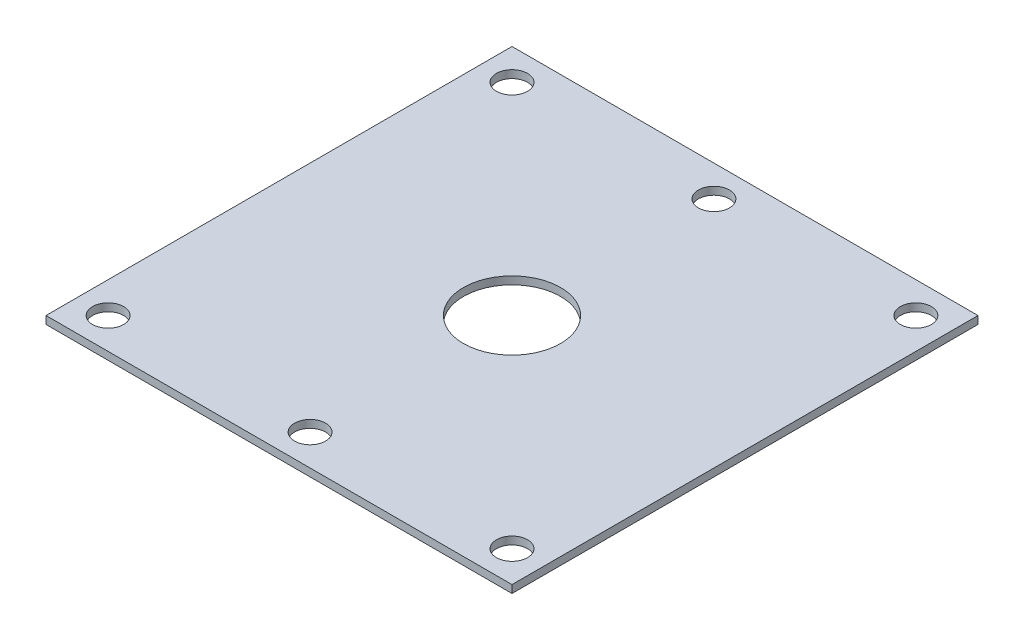
ISO-10303-21;
HEADER;
FILE_DESCRIPTION(('STEP AP214'),'2;1');
FILE_NAME('part.step','',(''),(''),'','','');
FILE_SCHEMA(('AUTOMOTIVE_DESIGN { 1 0 10303 214 1 1 1 1 }'));
ENDSEC;
DATA;
#1=APPLICATION_CONTEXT('core data for automotive mechanical design processes');
#2=APPLICATION_PROTOCOL_DEFINITION('international standard','automotive_design',2000,#1);
#3=PRODUCT_CONTEXT('',#1,'mechanical');
#4=PRODUCT('Part','Part','',(#3));
#5=PRODUCT_RELATED_PRODUCT_CATEGORY('part','',(#4));
#6=PRODUCT_DEFINITION_FORMATION('','',#4);
#7=PRODUCT_DEFINITION_CONTEXT('part definition',#1,'design');
#8=PRODUCT_DEFINITION('design','',#6,#7);
#9=PRODUCT_DEFINITION_SHAPE('','',#8);
#10=(LENGTH_UNIT() NAMED_UNIT(*) SI_UNIT(.MILLI.,.METRE.));
#11=(NAMED_UNIT(*) PLANE_ANGLE_UNIT() SI_UNIT($,.RADIAN.));
#12=(NAMED_UNIT(*) SI_UNIT($,.STERADIAN.) SOLID_ANGLE_UNIT());
#13=UNCERTAINTY_MEASURE_WITH_UNIT(LENGTH_MEASURE(1.E-05),#10,'distance_accuracy_value','');
#14=(GEOMETRIC_REPRESENTATION_CONTEXT(3) GLOBAL_UNCERTAINTY_ASSIGNED_CONTEXT((#13)) GLOBAL_UNIT_ASSIGNED_CONTEXT((#10,
#11,#12)) REPRESENTATION_CONTEXT('',''));
#15=CARTESIAN_POINT('',(0.,0.,0.));
#16=DIRECTION('',(0.,0.,1.));
#17=DIRECTION('',(1.,0.,0.));
#18=AXIS2_PLACEMENT_3D('',#15,#16,#17);
#19=CARTESIAN_POINT('',(-30.,1.,30.));
#20=DIRECTION('',(1.,0.,0.));
#21=DIRECTION('',(0.,0.,-1.));
#22=AXIS2_PLACEMENT_3D('',#19,#20,#21);
#23=PLANE('',#22);
#24=DIRECTION('',(0.,0.,1.));
#25=VECTOR('',#24,1.);
#26=CARTESIAN_POINT('',(-30.,0.,30.));
#27=LINE('',#26,#25);
#28=CARTESIAN_POINT('',(-30.,0.,-30.));
#29=VERTEX_POINT('',#28);
#30=CARTESIAN_POINT('',(-30.,0.,30.));
#31=VERTEX_POINT('',#30);
#32=EDGE_CURVE('E98',#29,#31,#27,.T.);
#33=ORIENTED_EDGE('',*,*,#32,.T.);
#34=DIRECTION('',(0.,-1.,0.));
#35=VECTOR('',#34,1.);
#36=CARTESIAN_POINT('',(-30.,1.,30.));
#37=LINE('',#36,#35);
#38=CARTESIAN_POINT('',(-30.,1.,30.));
#39=VERTEX_POINT('',#38);
#40=EDGE_CURVE('E11',#39,#31,#37,.T.);
#41=ORIENTED_EDGE('',*,*,#40,.F.);
#42=DIRECTION('',(0.,0.,1.));
#43=VECTOR('',#42,1.);
#44=CARTESIAN_POINT('',(-30.,1.,30.));
#45=LINE('',#44,#43);
#46=CARTESIAN_POINT('',(-30.,1.,-30.));
#47=VERTEX_POINT('',#46);
#48=EDGE_CURVE('E85',#47,#39,#45,.T.);
#49=ORIENTED_EDGE('',*,*,#48,.F.);
#50=DIRECTION('',(0.,-1.,0.));
#51=VECTOR('',#50,1.);
#52=CARTESIAN_POINT('',(-30.,1.,-30.));
#53=LINE('',#52,#51);
#54=EDGE_CURVE('E94',#47,#29,#53,.T.);
#55=ORIENTED_EDGE('',*,*,#54,.T.);
#56=EDGE_LOOP('',(#33,#41,#49,#55));
#57=FACE_BOUND('',#56,.T.);
#58=ADVANCED_FACE('F33',(#57),#23,.F.);
#59=CARTESIAN_POINT('',(30.,1.,30.));
#60=DIRECTION('',(0.,0.,-1.));
#61=DIRECTION('',(-1.,0.,0.));
#62=AXIS2_PLACEMENT_3D('',#59,#60,#61);
#63=PLANE('',#62);
#64=DIRECTION('',(1.,0.,0.));
#65=VECTOR('',#64,1.);
#66=CARTESIAN_POINT('',(30.,0.,30.));
#67=LINE('',#66,#65);
#68=CARTESIAN_POINT('',(30.,0.,30.));
#69=VERTEX_POINT('',#68);
#70=EDGE_CURVE('E89',#31,#69,#67,.T.);
#71=ORIENTED_EDGE('',*,*,#70,.T.);
#72=DIRECTION('',(0.,-1.,0.));
#73=VECTOR('',#72,1.);
#74=CARTESIAN_POINT('',(30.,1.,30.));
#75=LINE('',#74,#73);
#76=CARTESIAN_POINT('',(30.,1.,30.));
#77=VERTEX_POINT('',#76);
#78=EDGE_CURVE('E42',#77,#69,#75,.T.);
#79=ORIENTED_EDGE('',*,*,#78,.F.);
#80=DIRECTION('',(1.,0.,0.));
#81=VECTOR('',#80,1.);
#82=CARTESIAN_POINT('',(30.,1.,30.));
#83=LINE('',#82,#81);
#84=EDGE_CURVE('E80',#39,#77,#83,.T.);
#85=ORIENTED_EDGE('',*,*,#84,.F.);
#86=ORIENTED_EDGE('',*,*,#40,.T.);
#87=EDGE_LOOP('',(#71,#79,#85,#86));
#88=FACE_BOUND('',#87,.T.);
#89=ADVANCED_FACE('F88',(#88),#63,.F.);
#90=CARTESIAN_POINT('',(30.,1.,30.));
#91=DIRECTION('',(-1.,0.,0.));
#92=DIRECTION('',(0.,0.,1.));
#93=AXIS2_PLACEMENT_3D('',#90,#91,#92);
#94=PLANE('',#93);
#95=DIRECTION('',(0.,0.,-1.));
#96=VECTOR('',#95,1.);
#97=CARTESIAN_POINT('',(30.,0.,30.));
#98=LINE('',#97,#96);
#99=CARTESIAN_POINT('',(30.,0.,-30.));
#100=VERTEX_POINT('',#99);
#101=EDGE_CURVE('E67',#69,#100,#98,.T.);
#102=ORIENTED_EDGE('',*,*,#101,.T.);
#103=DIRECTION('',(0.,-1.,0.));
#104=VECTOR('',#103,1.);
#105=CARTESIAN_POINT('',(30.,1.,-30.));
#106=LINE('',#105,#104);
#107=CARTESIAN_POINT('',(30.,1.,-30.));
#108=VERTEX_POINT('',#107);
#109=EDGE_CURVE('E90',#108,#100,#106,.T.);
#110=ORIENTED_EDGE('',*,*,#109,.F.);
#111=DIRECTION('',(0.,0.,-1.));
#112=VECTOR('',#111,1.);
#113=CARTESIAN_POINT('',(30.,1.,30.));
#114=LINE('',#113,#112);
#115=EDGE_CURVE('E83',#77,#108,#114,.T.);
#116=ORIENTED_EDGE('',*,*,#115,.F.);
#117=ORIENTED_EDGE('',*,*,#78,.T.);
#118=EDGE_LOOP('',(#102,#110,#116,#117));
#119=FACE_BOUND('',#118,.T.);
#120=ADVANCED_FACE('F92',(#119),#94,.F.);
#121=CARTESIAN_POINT('',(30.,1.,-30.));
#122=DIRECTION('',(0.,0.,1.));
#123=DIRECTION('',(1.,0.,0.));
#124=AXIS2_PLACEMENT_3D('',#121,#122,#123);
#125=PLANE('',#124);
#126=DIRECTION('',(-1.,0.,0.));
#127=VECTOR('',#126,1.);
#128=CARTESIAN_POINT('',(30.,0.,-30.));
#129=LINE('',#128,#127);
#130=EDGE_CURVE('E73',#100,#29,#129,.T.);
#131=ORIENTED_EDGE('',*,*,#130,.T.);
#132=ORIENTED_EDGE('',*,*,#54,.F.);
#133=DIRECTION('',(-1.,0.,0.));
#134=VECTOR('',#133,1.);
#135=CARTESIAN_POINT('',(30.,1.,-30.));
#136=LINE('',#135,#134);
#137=EDGE_CURVE('E50',#108,#47,#136,.T.);
#138=ORIENTED_EDGE('',*,*,#137,.F.);
#139=ORIENTED_EDGE('',*,*,#109,.T.);
#140=EDGE_LOOP('',(#131,#132,#138,#139));
#141=FACE_BOUND('',#140,.T.);
#142=ADVANCED_FACE('F106',(#141),#125,.F.);
#143=CARTESIAN_POINT('',(0.,1.,0.));
#144=DIRECTION('',(0.,1.,0.));
#145=DIRECTION('',(0.,0.,1.));
#146=AXIS2_PLACEMENT_3D('',#143,#144,#145);
#147=PLANE('',#146);
#148=CARTESIAN_POINT('',(0.,1.,0.));
#149=DIRECTION('',(0.,1.,0.));
#150=DIRECTION('',(0.,0.,1.));
#151=AXIS2_PLACEMENT_3D('',#148,#149,#150);
#152=CIRCLE('',#151,6.25);
#153=CARTESIAN_POINT('',(0.,1.,6.25));
#154=VERTEX_POINT('',#153);
#155=EDGE_CURVE('E147',#154,#154,#152,.T.);
#156=ORIENTED_EDGE('',*,*,#155,.F.);
#157=EDGE_LOOP('',(#156));
#158=FACE_BOUND('',#157,.T.);
#159=CARTESIAN_POINT('',(-26.,1.,26.));
#160=DIRECTION('',(0.,1.,0.));
#161=DIRECTION('',(0.,0.,1.));
#162=AXIS2_PLACEMENT_3D('',#159,#160,#161);
#163=CIRCLE('',#162,2.);
#164=CARTESIAN_POINT('',(-26.,1.,28.));
#165=VERTEX_POINT('',#164);
#166=EDGE_CURVE('E142',#165,#165,#163,.T.);
#167=ORIENTED_EDGE('',*,*,#166,.F.);
#168=EDGE_LOOP('',(#167));
#169=FACE_BOUND('',#168,.T.);
#170=CARTESIAN_POINT('',(0.,1.,26.));
#171=DIRECTION('',(0.,1.,0.));
#172=DIRECTION('',(0.,0.,1.));
#173=AXIS2_PLACEMENT_3D('',#170,#171,#172);
#174=CIRCLE('',#173,2.);
#175=CARTESIAN_POINT('',(0.,1.,28.));
#176=VERTEX_POINT('',#175);
#177=EDGE_CURVE('E136',#176,#176,#174,.T.);
#178=ORIENTED_EDGE('',*,*,#177,.F.);
#179=EDGE_LOOP('',(#178));
#180=FACE_BOUND('',#179,.T.);
#181=CARTESIAN_POINT('',(26.,1.,26.));
#182=DIRECTION('',(0.,1.,0.));
#183=DIRECTION('',(0.,0.,1.));
#184=AXIS2_PLACEMENT_3D('',#181,#182,#183);
#185=CIRCLE('',#184,2.);
#186=CARTESIAN_POINT('',(26.,1.,28.));
#187=VERTEX_POINT('',#186);
#188=EDGE_CURVE('E130',#187,#187,#185,.T.);
#189=ORIENTED_EDGE('',*,*,#188,.F.);
#190=EDGE_LOOP('',(#189));
#191=FACE_BOUND('',#190,.T.);
#192=CARTESIAN_POINT('',(26.,1.,-26.));
#193=DIRECTION('',(0.,1.,0.));
#194=DIRECTION('',(0.,0.,1.));
#195=AXIS2_PLACEMENT_3D('',#192,#193,#194);
#196=CIRCLE('',#195,2.);
#197=CARTESIAN_POINT('',(26.,1.,-24.));
#198=VERTEX_POINT('',#197);
#199=EDGE_CURVE('E124',#198,#198,#196,.T.);
#200=ORIENTED_EDGE('',*,*,#199,.F.);
#201=EDGE_LOOP('',(#200));
#202=FACE_BOUND('',#201,.T.);
#203=CARTESIAN_POINT('',(0.,1.,-26.));
#204=DIRECTION('',(0.,1.,0.));
#205=DIRECTION('',(0.,0.,1.));
#206=AXIS2_PLACEMENT_3D('',#203,#204,#205);
#207=CIRCLE('',#206,2.);
#208=CARTESIAN_POINT('',(0.,1.,-24.));
#209=VERTEX_POINT('',#208);
#210=EDGE_CURVE('E118',#209,#209,#207,.T.);
#211=ORIENTED_EDGE('',*,*,#210,.F.);
#212=EDGE_LOOP('',(#211));
#213=FACE_BOUND('',#212,.T.);
#214=CARTESIAN_POINT('',(-26.,1.,-26.));
#215=DIRECTION('',(0.,1.,0.));
#216=DIRECTION('',(0.,0.,1.));
#217=AXIS2_PLACEMENT_3D('',#214,#215,#216);
#218=CIRCLE('',#217,2.);
#219=CARTESIAN_POINT('',(-26.,1.,-24.));
#220=VERTEX_POINT('',#219);
#221=EDGE_CURVE('E112',#220,#220,#218,.T.);
#222=ORIENTED_EDGE('',*,*,#221,.F.);
#223=EDGE_LOOP('',(#222));
#224=FACE_BOUND('',#223,.T.);
#225=ORIENTED_EDGE('',*,*,#48,.T.);
#226=ORIENTED_EDGE('',*,*,#84,.T.);
#227=ORIENTED_EDGE('',*,*,#115,.T.);
#228=ORIENTED_EDGE('',*,*,#137,.T.);
#229=EDGE_LOOP('',(#225,#226,#227,#228));
#230=FACE_BOUND('',#229,.T.);
#231=ADVANCED_FACE('F81',(#158,#169,#180,#191,#202,#213,#224,#230),#147,.T.);
#232=CARTESIAN_POINT('',(0.,0.,0.));
#233=DIRECTION('',(0.,1.,0.));
#234=DIRECTION('',(0.,0.,1.));
#235=AXIS2_PLACEMENT_3D('',#232,#233,#234);
#236=PLANE('',#235);
#237=CARTESIAN_POINT('',(0.,0.,0.));
#238=DIRECTION('',(0.,1.,0.));
#239=DIRECTION('',(0.,0.,1.));
#240=AXIS2_PLACEMENT_3D('',#237,#238,#239);
#241=CIRCLE('',#240,6.25);
#242=CARTESIAN_POINT('',(0.,0.,6.25));
#243=VERTEX_POINT('',#242);
#244=EDGE_CURVE('E36',#243,#243,#241,.T.);
#245=ORIENTED_EDGE('',*,*,#244,.T.);
#246=EDGE_LOOP('',(#245));
#247=FACE_BOUND('',#246,.T.);
#248=CARTESIAN_POINT('',(-26.,0.,26.));
#249=DIRECTION('',(0.,1.,0.));
#250=DIRECTION('',(0.,0.,1.));
#251=AXIS2_PLACEMENT_3D('',#248,#249,#250);
#252=CIRCLE('',#251,2.);
#253=CARTESIAN_POINT('',(-26.,0.,28.));
#254=VERTEX_POINT('',#253);
#255=EDGE_CURVE('E139',#254,#254,#252,.T.);
#256=ORIENTED_EDGE('',*,*,#255,.T.);
#257=EDGE_LOOP('',(#256));
#258=FACE_BOUND('',#257,.T.);
#259=CARTESIAN_POINT('',(0.,0.,26.));
#260=DIRECTION('',(0.,1.,0.));
#261=DIRECTION('',(0.,0.,1.));
#262=AXIS2_PLACEMENT_3D('',#259,#260,#261);
#263=CIRCLE('',#262,2.);
#264=CARTESIAN_POINT('',(0.,0.,28.));
#265=VERTEX_POINT('',#264);
#266=EDGE_CURVE('E133',#265,#265,#263,.T.);
#267=ORIENTED_EDGE('',*,*,#266,.T.);
#268=EDGE_LOOP('',(#267));
#269=FACE_BOUND('',#268,.T.);
#270=CARTESIAN_POINT('',(26.,0.,26.));
#271=DIRECTION('',(0.,1.,0.));
#272=DIRECTION('',(0.,0.,1.));
#273=AXIS2_PLACEMENT_3D('',#270,#271,#272);
#274=CIRCLE('',#273,2.);
#275=CARTESIAN_POINT('',(26.,0.,28.));
#276=VERTEX_POINT('',#275);
#277=EDGE_CURVE('E127',#276,#276,#274,.T.);
#278=ORIENTED_EDGE('',*,*,#277,.T.);
#279=EDGE_LOOP('',(#278));
#280=FACE_BOUND('',#279,.T.);
#281=CARTESIAN_POINT('',(26.,0.,-26.));
#282=DIRECTION('',(0.,1.,0.));
#283=DIRECTION('',(0.,0.,1.));
#284=AXIS2_PLACEMENT_3D('',#281,#282,#283);
#285=CIRCLE('',#284,2.);
#286=CARTESIAN_POINT('',(26.,0.,-24.));
#287=VERTEX_POINT('',#286);
#288=EDGE_CURVE('E121',#287,#287,#285,.T.);
#289=ORIENTED_EDGE('',*,*,#288,.T.);
#290=EDGE_LOOP('',(#289));
#291=FACE_BOUND('',#290,.T.);
#292=CARTESIAN_POINT('',(0.,0.,-26.));
#293=DIRECTION('',(0.,1.,0.));
#294=DIRECTION('',(0.,0.,1.));
#295=AXIS2_PLACEMENT_3D('',#292,#293,#294);
#296=CIRCLE('',#295,2.);
#297=CARTESIAN_POINT('',(0.,0.,-24.));
#298=VERTEX_POINT('',#297);
#299=EDGE_CURVE('E115',#298,#298,#296,.T.);
#300=ORIENTED_EDGE('',*,*,#299,.T.);
#301=EDGE_LOOP('',(#300));
#302=FACE_BOUND('',#301,.T.);
#303=CARTESIAN_POINT('',(-26.,0.,-26.));
#304=DIRECTION('',(0.,1.,0.));
#305=DIRECTION('',(0.,0.,1.));
#306=AXIS2_PLACEMENT_3D('',#303,#304,#305);
#307=CIRCLE('',#306,2.);
#308=CARTESIAN_POINT('',(-26.,0.,-24.));
#309=VERTEX_POINT('',#308);
#310=EDGE_CURVE('E101',#309,#309,#307,.T.);
#311=ORIENTED_EDGE('',*,*,#310,.T.);
#312=EDGE_LOOP('',(#311));
#313=FACE_BOUND('',#312,.T.);
#314=ORIENTED_EDGE('',*,*,#32,.F.);
#315=ORIENTED_EDGE('',*,*,#130,.F.);
#316=ORIENTED_EDGE('',*,*,#101,.F.);
#317=ORIENTED_EDGE('',*,*,#70,.F.);
#318=EDGE_LOOP('',(#314,#315,#316,#317));
#319=FACE_BOUND('',#318,.T.);
#320=ADVANCED_FACE('F109',(#247,#258,#269,#280,#291,#302,#313,#319),#236,.F.);
#321=CARTESIAN_POINT('',(-26.,0.,-26.));
#322=DIRECTION('',(0.,1.,0.));
#323=DIRECTION('',(0.,0.,1.));
#324=AXIS2_PLACEMENT_3D('',#321,#322,#323);
#325=CYLINDRICAL_SURFACE('',#324,2.);
#326=ORIENTED_EDGE('',*,*,#310,.F.);
#327=EDGE_LOOP('',(#326));
#328=FACE_BOUND('',#327,.T.);
#329=ORIENTED_EDGE('',*,*,#221,.T.);
#330=EDGE_LOOP('',(#329));
#331=FACE_BOUND('',#330,.T.);
#332=ADVANCED_FACE('F179',(#328,#331),#325,.F.);
#333=CARTESIAN_POINT('',(0.,0.,-26.));
#334=DIRECTION('',(0.,1.,0.));
#335=DIRECTION('',(0.,0.,1.));
#336=AXIS2_PLACEMENT_3D('',#333,#334,#335);
#337=CYLINDRICAL_SURFACE('',#336,2.);
#338=ORIENTED_EDGE('',*,*,#299,.F.);
#339=EDGE_LOOP('',(#338));
#340=FACE_BOUND('',#339,.T.);
#341=ORIENTED_EDGE('',*,*,#210,.T.);
#342=EDGE_LOOP('',(#341));
#343=FACE_BOUND('',#342,.T.);
#344=ADVANCED_FACE('F185',(#340,#343),#337,.F.);
#345=CARTESIAN_POINT('',(26.,0.,-26.));
#346=DIRECTION('',(0.,1.,0.));
#347=DIRECTION('',(0.,0.,1.));
#348=AXIS2_PLACEMENT_3D('',#345,#346,#347);
#349=CYLINDRICAL_SURFACE('',#348,2.);
#350=ORIENTED_EDGE('',*,*,#288,.F.);
#351=EDGE_LOOP('',(#350));
#352=FACE_BOUND('',#351,.T.);
#353=ORIENTED_EDGE('',*,*,#199,.T.);
#354=EDGE_LOOP('',(#353));
#355=FACE_BOUND('',#354,.T.);
#356=ADVANCED_FACE('F189',(#352,#355),#349,.F.);
#357=CARTESIAN_POINT('',(26.,0.,26.));
#358=DIRECTION('',(0.,1.,0.));
#359=DIRECTION('',(0.,0.,1.));
#360=AXIS2_PLACEMENT_3D('',#357,#358,#359);
#361=CYLINDRICAL_SURFACE('',#360,2.);
#362=ORIENTED_EDGE('',*,*,#277,.F.);
#363=EDGE_LOOP('',(#362));
#364=FACE_BOUND('',#363,.T.);
#365=ORIENTED_EDGE('',*,*,#188,.T.);
#366=EDGE_LOOP('',(#365));
#367=FACE_BOUND('',#366,.T.);
#368=ADVANCED_FACE('F193',(#364,#367),#361,.F.);
#369=CARTESIAN_POINT('',(0.,0.,26.));
#370=DIRECTION('',(0.,1.,0.));
#371=DIRECTION('',(0.,0.,1.));
#372=AXIS2_PLACEMENT_3D('',#369,#370,#371);
#373=CYLINDRICAL_SURFACE('',#372,2.);
#374=ORIENTED_EDGE('',*,*,#266,.F.);
#375=EDGE_LOOP('',(#374));
#376=FACE_BOUND('',#375,.T.);
#377=ORIENTED_EDGE('',*,*,#177,.T.);
#378=EDGE_LOOP('',(#377));
#379=FACE_BOUND('',#378,.T.);
#380=ADVANCED_FACE('F163',(#376,#379),#373,.F.);
#381=CARTESIAN_POINT('',(-26.,0.,26.));
#382=DIRECTION('',(0.,1.,0.));
#383=DIRECTION('',(0.,0.,1.));
#384=AXIS2_PLACEMENT_3D('',#381,#382,#383);
#385=CYLINDRICAL_SURFACE('',#384,2.);
#386=ORIENTED_EDGE('',*,*,#255,.F.);
#387=EDGE_LOOP('',(#386));
#388=FACE_BOUND('',#387,.T.);
#389=ORIENTED_EDGE('',*,*,#166,.T.);
#390=EDGE_LOOP('',(#389));
#391=FACE_BOUND('',#390,.T.);
#392=ADVANCED_FACE('F158',(#388,#391),#385,.F.);
#393=CARTESIAN_POINT('',(0.,-9.,0.));
#394=DIRECTION('',(0.,1.,0.));
#395=DIRECTION('',(0.,0.,1.));
#396=AXIS2_PLACEMENT_3D('',#393,#394,#395);
#397=CYLINDRICAL_SURFACE('',#396,6.25);
#398=ORIENTED_EDGE('',*,*,#155,.T.);
#399=EDGE_LOOP('',(#398));
#400=FACE_BOUND('',#399,.T.);
#401=ORIENTED_EDGE('',*,*,#244,.F.);
#402=EDGE_LOOP('',(#401));
#403=FACE_BOUND('',#402,.T.);
#404=ADVANCED_FACE('F156',(#400,#403),#397,.F.);
#405=CLOSED_SHELL('',(#58,#89,#120,#142,#231,#320,#332,#344,#356,#368,#380,#392,#404));
#406=MANIFOLD_SOLID_BREP('B2',#405);
#407=ADVANCED_BREP_SHAPE_REPRESENTATION('',(#18,#406),#14);
#408=SHAPE_DEFINITION_REPRESENTATION(#9,#407);
ENDSEC;
END-ISO-10303-21;
